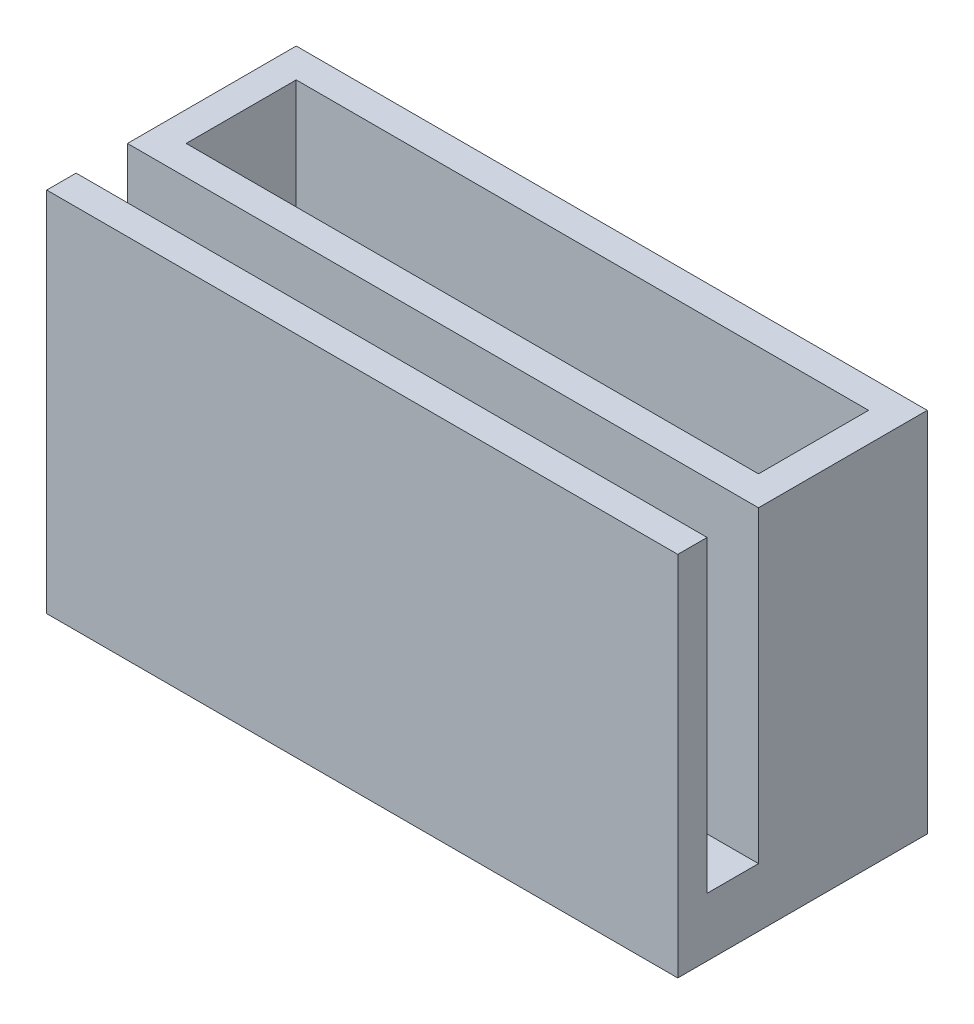
ISO-10303-21;
HEADER;
FILE_DESCRIPTION(('STEP AP214'),'2;1');
FILE_NAME('part.step','',(''),(''),'','','');
FILE_SCHEMA(('AUTOMOTIVE_DESIGN { 1 0 10303 214 1 1 1 1 }'));
ENDSEC;
DATA;
#1=APPLICATION_CONTEXT('core data for automotive mechanical design processes');
#2=APPLICATION_PROTOCOL_DEFINITION('international standard','automotive_design',2000,#1);
#3=PRODUCT_CONTEXT('',#1,'mechanical');
#4=PRODUCT('Part','Part','',(#3));
#5=PRODUCT_RELATED_PRODUCT_CATEGORY('part','',(#4));
#6=PRODUCT_DEFINITION_FORMATION('','',#4);
#7=PRODUCT_DEFINITION_CONTEXT('part definition',#1,'design');
#8=PRODUCT_DEFINITION('design','',#6,#7);
#9=PRODUCT_DEFINITION_SHAPE('','',#8);
#10=(LENGTH_UNIT() NAMED_UNIT(*) SI_UNIT(.MILLI.,.METRE.));
#11=(NAMED_UNIT(*) PLANE_ANGLE_UNIT() SI_UNIT($,.RADIAN.));
#12=(NAMED_UNIT(*) SI_UNIT($,.STERADIAN.) SOLID_ANGLE_UNIT());
#13=UNCERTAINTY_MEASURE_WITH_UNIT(LENGTH_MEASURE(1.E-05),#10,'distance_accuracy_value','');
#14=(GEOMETRIC_REPRESENTATION_CONTEXT(3) GLOBAL_UNCERTAINTY_ASSIGNED_CONTEXT((#13)) GLOBAL_UNIT_ASSIGNED_CONTEXT((#10,
#11,#12)) REPRESENTATION_CONTEXT('',''));
#15=CARTESIAN_POINT('',(0.,0.,0.));
#16=DIRECTION('',(0.,0.,1.));
#17=DIRECTION('',(1.,0.,0.));
#18=AXIS2_PLACEMENT_3D('',#15,#16,#17);
#19=CARTESIAN_POINT('',(0.,4.,0.));
#20=DIRECTION('',(0.,1.,0.));
#21=DIRECTION('',(0.,0.,1.));
#22=AXIS2_PLACEMENT_3D('',#19,#20,#21);
#23=PLANE('',#22);
#24=DIRECTION('',(0.,0.,-1.));
#25=VECTOR('',#24,1.);
#26=CARTESIAN_POINT('',(-2.,4.,2.));
#27=LINE('',#26,#25);
#28=CARTESIAN_POINT('',(-2.,4.,5.50000000000001));
#29=VERTEX_POINT('',#28);
#30=CARTESIAN_POINT('',(-2.,4.,2.));
#31=VERTEX_POINT('',#30);
#32=EDGE_CURVE('E148',#29,#31,#27,.T.);
#33=ORIENTED_EDGE('',*,*,#32,.F.);
#34=DIRECTION('',(-1.,0.,0.));
#35=VECTOR('',#34,1.);
#36=CARTESIAN_POINT('',(41.,4.,5.5));
#37=LINE('',#36,#35);
#38=CARTESIAN_POINT('',(41.,4.,5.5));
#39=VERTEX_POINT('',#38);
#40=EDGE_CURVE('E139',#39,#29,#37,.T.);
#41=ORIENTED_EDGE('',*,*,#40,.F.);
#42=DIRECTION('',(0.,0.,1.));
#43=VECTOR('',#42,1.);
#44=CARTESIAN_POINT('',(41.,4.,2.));
#45=LINE('',#44,#43);
#46=CARTESIAN_POINT('',(41.,4.,2.));
#47=VERTEX_POINT('',#46);
#48=EDGE_CURVE('E59',#47,#39,#45,.T.);
#49=ORIENTED_EDGE('',*,*,#48,.F.);
#50=DIRECTION('',(1.,0.,0.));
#51=VECTOR('',#50,1.);
#52=CARTESIAN_POINT('',(-2.,4.,2.));
#53=LINE('',#52,#51);
#54=EDGE_CURVE('E157',#31,#47,#53,.T.);
#55=ORIENTED_EDGE('',*,*,#54,.F.);
#56=EDGE_LOOP('',(#33,#41,#49,#55));
#57=FACE_BOUND('',#56,.T.);
#58=ADVANCED_FACE('F43',(#57),#23,.T.);
#59=CARTESIAN_POINT('',(0.,25.,0.));
#60=DIRECTION('',(0.,-1.,0.));
#61=DIRECTION('',(0.,0.,-1.));
#62=AXIS2_PLACEMENT_3D('',#59,#60,#61);
#63=PLANE('',#62);
#64=DIRECTION('',(0.,0.,1.));
#65=VECTOR('',#64,1.);
#66=CARTESIAN_POINT('',(-2.,25.,2.));
#67=LINE('',#66,#65);
#68=CARTESIAN_POINT('',(-2.,25.,-9.5));
#69=VERTEX_POINT('',#68);
#70=CARTESIAN_POINT('',(-2.,25.,2.));
#71=VERTEX_POINT('',#70);
#72=EDGE_CURVE('E217',#69,#71,#67,.T.);
#73=ORIENTED_EDGE('',*,*,#72,.T.);
#74=DIRECTION('',(1.,0.,0.));
#75=VECTOR('',#74,1.);
#76=CARTESIAN_POINT('',(-2.,25.,2.));
#77=LINE('',#76,#75);
#78=CARTESIAN_POINT('',(41.,25.,2.));
#79=VERTEX_POINT('',#78);
#80=EDGE_CURVE('E221',#71,#79,#77,.T.);
#81=ORIENTED_EDGE('',*,*,#80,.T.);
#82=DIRECTION('',(0.,0.,-1.));
#83=VECTOR('',#82,1.);
#84=CARTESIAN_POINT('',(41.,25.,2.));
#85=LINE('',#84,#83);
#86=CARTESIAN_POINT('',(41.,25.,-9.5));
#87=VERTEX_POINT('',#86);
#88=EDGE_CURVE('E225',#79,#87,#85,.T.);
#89=ORIENTED_EDGE('',*,*,#88,.T.);
#90=DIRECTION('',(-1.,0.,0.));
#91=VECTOR('',#90,1.);
#92=CARTESIAN_POINT('',(-2.,25.,-9.5));
#93=LINE('',#92,#91);
#94=EDGE_CURVE('E228',#87,#69,#93,.T.);
#95=ORIENTED_EDGE('',*,*,#94,.T.);
#96=EDGE_LOOP('',(#73,#81,#89,#95));
#97=FACE_BOUND('',#96,.T.);
#98=DIRECTION('',(0.,0.,1.));
#99=VECTOR('',#98,1.);
#100=CARTESIAN_POINT('',(0.,25.,0.));
#101=LINE('',#100,#99);
#102=CARTESIAN_POINT('',(0.,25.,-7.5));
#103=VERTEX_POINT('',#102);
#104=CARTESIAN_POINT('',(0.,25.,0.));
#105=VERTEX_POINT('',#104);
#106=EDGE_CURVE('E176',#103,#105,#101,.T.);
#107=ORIENTED_EDGE('',*,*,#106,.F.);
#108=DIRECTION('',(-1.,0.,0.));
#109=VECTOR('',#108,1.);
#110=CARTESIAN_POINT('',(0.,25.,-7.5));
#111=LINE('',#110,#109);
#112=CARTESIAN_POINT('',(39.,25.,-7.5));
#113=VERTEX_POINT('',#112);
#114=EDGE_CURVE('E186',#113,#103,#111,.T.);
#115=ORIENTED_EDGE('',*,*,#114,.F.);
#116=DIRECTION('',(0.,0.,-1.));
#117=VECTOR('',#116,1.);
#118=CARTESIAN_POINT('',(39.,25.,0.));
#119=LINE('',#118,#117);
#120=CARTESIAN_POINT('',(39.,25.,0.));
#121=VERTEX_POINT('',#120);
#122=EDGE_CURVE('E183',#121,#113,#119,.T.);
#123=ORIENTED_EDGE('',*,*,#122,.F.);
#124=DIRECTION('',(1.,0.,0.));
#125=VECTOR('',#124,1.);
#126=CARTESIAN_POINT('',(0.,25.,0.));
#127=LINE('',#126,#125);
#128=EDGE_CURVE('E179',#105,#121,#127,.T.);
#129=ORIENTED_EDGE('',*,*,#128,.F.);
#130=EDGE_LOOP('',(#107,#115,#123,#129));
#131=FACE_BOUND('',#130,.T.);
#132=ADVANCED_FACE('F277',(#97,#131),#63,.F.);
#133=CARTESIAN_POINT('',(0.,0.,0.));
#134=DIRECTION('',(0.,-1.,0.));
#135=DIRECTION('',(0.,0.,-1.));
#136=AXIS2_PLACEMENT_3D('',#133,#134,#135);
#137=PLANE('',#136);
#138=DIRECTION('',(0.,0.,1.));
#139=VECTOR('',#138,1.);
#140=CARTESIAN_POINT('',(-2.,0.,2.));
#141=LINE('',#140,#139);
#142=CARTESIAN_POINT('',(-2.,0.,-9.5));
#143=VERTEX_POINT('',#142);
#144=CARTESIAN_POINT('',(-2.,0.,7.5));
#145=VERTEX_POINT('',#144);
#146=EDGE_CURVE('E216',#143,#145,#141,.T.);
#147=ORIENTED_EDGE('',*,*,#146,.F.);
#148=DIRECTION('',(-1.,0.,0.));
#149=VECTOR('',#148,1.);
#150=CARTESIAN_POINT('',(-2.,0.,-9.5));
#151=LINE('',#150,#149);
#152=CARTESIAN_POINT('',(41.,0.,-9.5));
#153=VERTEX_POINT('',#152);
#154=EDGE_CURVE('E222',#153,#143,#151,.T.);
#155=ORIENTED_EDGE('',*,*,#154,.F.);
#156=DIRECTION('',(0.,0.,-1.));
#157=VECTOR('',#156,1.);
#158=CARTESIAN_POINT('',(41.,0.,2.));
#159=LINE('',#158,#157);
#160=CARTESIAN_POINT('',(41.,0.,7.5));
#161=VERTEX_POINT('',#160);
#162=EDGE_CURVE('E234',#161,#153,#159,.T.);
#163=ORIENTED_EDGE('',*,*,#162,.F.);
#164=DIRECTION('',(-1.,0.,0.));
#165=VECTOR('',#164,1.);
#166=CARTESIAN_POINT('',(-2.,0.,7.5));
#167=LINE('',#166,#165);
#168=EDGE_CURVE('E167',#161,#145,#167,.T.);
#169=ORIENTED_EDGE('',*,*,#168,.T.);
#170=EDGE_LOOP('',(#147,#155,#163,#169));
#171=FACE_BOUND('',#170,.T.);
#172=DIRECTION('',(-1.,0.,0.));
#173=VECTOR('',#172,1.);
#174=CARTESIAN_POINT('',(0.,0.,-7.5));
#175=LINE('',#174,#173);
#176=CARTESIAN_POINT('',(39.,0.,-7.5));
#177=VERTEX_POINT('',#176);
#178=CARTESIAN_POINT('',(0.,0.,-7.5));
#179=VERTEX_POINT('',#178);
#180=EDGE_CURVE('E180',#177,#179,#175,.T.);
#181=ORIENTED_EDGE('',*,*,#180,.T.);
#182=DIRECTION('',(0.,0.,1.));
#183=VECTOR('',#182,1.);
#184=CARTESIAN_POINT('',(0.,0.,0.));
#185=LINE('',#184,#183);
#186=CARTESIAN_POINT('',(0.,0.,0.));
#187=VERTEX_POINT('',#186);
#188=EDGE_CURVE('E174',#179,#187,#185,.T.);
#189=ORIENTED_EDGE('',*,*,#188,.T.);
#190=DIRECTION('',(1.,0.,0.));
#191=VECTOR('',#190,1.);
#192=CARTESIAN_POINT('',(0.,0.,0.));
#193=LINE('',#192,#191);
#194=CARTESIAN_POINT('',(39.,0.,0.));
#195=VERTEX_POINT('',#194);
#196=EDGE_CURVE('E193',#187,#195,#193,.T.);
#197=ORIENTED_EDGE('',*,*,#196,.T.);
#198=DIRECTION('',(0.,0.,-1.));
#199=VECTOR('',#198,1.);
#200=CARTESIAN_POINT('',(39.,0.,0.));
#201=LINE('',#200,#199);
#202=EDGE_CURVE('E197',#195,#177,#201,.T.);
#203=ORIENTED_EDGE('',*,*,#202,.T.);
#204=EDGE_LOOP('',(#181,#189,#197,#203));
#205=FACE_BOUND('',#204,.T.);
#206=ADVANCED_FACE('F254',(#171,#205),#137,.T.);
#207=CARTESIAN_POINT('',(-2.,25.,2.));
#208=DIRECTION('',(1.,0.,0.));
#209=DIRECTION('',(0.,0.,-1.));
#210=AXIS2_PLACEMENT_3D('',#207,#208,#209);
#211=PLANE('',#210);
#212=ORIENTED_EDGE('',*,*,#146,.T.);
#213=DIRECTION('',(0.,-1.,0.));
#214=VECTOR('',#213,1.);
#215=CARTESIAN_POINT('',(-2.,4.,7.5));
#216=LINE('',#215,#214);
#217=CARTESIAN_POINT('',(-2.,25.,7.50000000000001));
#218=VERTEX_POINT('',#217);
#219=EDGE_CURVE('E162',#218,#145,#216,.T.);
#220=ORIENTED_EDGE('',*,*,#219,.F.);
#221=DIRECTION('',(0.,0.,-1.));
#222=VECTOR('',#221,1.);
#223=CARTESIAN_POINT('',(-2.,25.,7.50000000000001));
#224=LINE('',#223,#222);
#225=CARTESIAN_POINT('',(-2.,25.,5.50000000000001));
#226=VERTEX_POINT('',#225);
#227=EDGE_CURVE('E267',#218,#226,#224,.T.);
#228=ORIENTED_EDGE('',*,*,#227,.T.);
#229=DIRECTION('',(0.,-1.,0.));
#230=VECTOR('',#229,1.);
#231=CARTESIAN_POINT('',(-2.,68.0464865000618,5.50000000000001));
#232=LINE('',#231,#230);
#233=EDGE_CURVE('E146',#226,#29,#232,.T.);
#234=ORIENTED_EDGE('',*,*,#233,.T.);
#235=ORIENTED_EDGE('',*,*,#32,.T.);
#236=DIRECTION('',(0.,-1.,0.));
#237=VECTOR('',#236,1.);
#238=CARTESIAN_POINT('',(-2.,25.,2.));
#239=LINE('',#238,#237);
#240=EDGE_CURVE('E11',#71,#31,#239,.T.);
#241=ORIENTED_EDGE('',*,*,#240,.F.);
#242=ORIENTED_EDGE('',*,*,#72,.F.);
#243=DIRECTION('',(0.,-1.,0.));
#244=VECTOR('',#243,1.);
#245=CARTESIAN_POINT('',(-2.,25.,-9.5));
#246=LINE('',#245,#244);
#247=EDGE_CURVE('E231',#69,#143,#246,.T.);
#248=ORIENTED_EDGE('',*,*,#247,.T.);
#249=EDGE_LOOP('',(#212,#220,#228,#234,#235,#241,#242,#248));
#250=FACE_BOUND('',#249,.T.);
#251=ADVANCED_FACE('F45',(#250),#211,.F.);
#252=CARTESIAN_POINT('',(-2.,25.,2.));
#253=DIRECTION('',(0.,0.,-1.));
#254=DIRECTION('',(-1.,0.,0.));
#255=AXIS2_PLACEMENT_3D('',#252,#253,#254);
#256=PLANE('',#255);
#257=ORIENTED_EDGE('',*,*,#240,.T.);
#258=ORIENTED_EDGE('',*,*,#54,.T.);
#259=DIRECTION('',(0.,-1.,0.));
#260=VECTOR('',#259,1.);
#261=CARTESIAN_POINT('',(41.,25.,2.));
#262=LINE('',#261,#260);
#263=EDGE_CURVE('E52',#79,#47,#262,.T.);
#264=ORIENTED_EDGE('',*,*,#263,.F.);
#265=ORIENTED_EDGE('',*,*,#80,.F.);
#266=EDGE_LOOP('',(#257,#258,#264,#265));
#267=FACE_BOUND('',#266,.T.);
#268=ADVANCED_FACE('F275',(#267),#256,.F.);
#269=CARTESIAN_POINT('',(41.,25.,2.));
#270=DIRECTION('',(-1.,0.,0.));
#271=DIRECTION('',(0.,0.,1.));
#272=AXIS2_PLACEMENT_3D('',#269,#270,#271);
#273=PLANE('',#272);
#274=ORIENTED_EDGE('',*,*,#162,.T.);
#275=DIRECTION('',(0.,-1.,0.));
#276=VECTOR('',#275,1.);
#277=CARTESIAN_POINT('',(41.,25.,-9.5));
#278=LINE('',#277,#276);
#279=EDGE_CURVE('E242',#87,#153,#278,.T.);
#280=ORIENTED_EDGE('',*,*,#279,.F.);
#281=ORIENTED_EDGE('',*,*,#88,.F.);
#282=ORIENTED_EDGE('',*,*,#263,.T.);
#283=ORIENTED_EDGE('',*,*,#48,.T.);
#284=DIRECTION('',(0.,-1.,0.));
#285=VECTOR('',#284,1.);
#286=CARTESIAN_POINT('',(41.,68.0464865000618,5.5));
#287=LINE('',#286,#285);
#288=CARTESIAN_POINT('',(41.,25.,5.5));
#289=VERTEX_POINT('',#288);
#290=EDGE_CURVE('E136',#289,#39,#287,.T.);
#291=ORIENTED_EDGE('',*,*,#290,.F.);
#292=DIRECTION('',(0.,0.,1.));
#293=VECTOR('',#292,1.);
#294=CARTESIAN_POINT('',(41.,25.,7.5));
#295=LINE('',#294,#293);
#296=CARTESIAN_POINT('',(41.,25.,7.5));
#297=VERTEX_POINT('',#296);
#298=EDGE_CURVE('E171',#289,#297,#295,.T.);
#299=ORIENTED_EDGE('',*,*,#298,.T.);
#300=DIRECTION('',(0.,-1.,0.));
#301=VECTOR('',#300,1.);
#302=CARTESIAN_POINT('',(41.,4.,7.5));
#303=LINE('',#302,#301);
#304=EDGE_CURVE('E156',#297,#161,#303,.T.);
#305=ORIENTED_EDGE('',*,*,#304,.T.);
#306=EDGE_LOOP('',(#274,#280,#281,#282,#283,#291,#299,#305));
#307=FACE_BOUND('',#306,.T.);
#308=ADVANCED_FACE('F152',(#307),#273,.F.);
#309=CARTESIAN_POINT('',(-2.,25.,-9.5));
#310=DIRECTION('',(0.,0.,1.));
#311=DIRECTION('',(1.,0.,0.));
#312=AXIS2_PLACEMENT_3D('',#309,#310,#311);
#313=PLANE('',#312);
#314=ORIENTED_EDGE('',*,*,#154,.T.);
#315=ORIENTED_EDGE('',*,*,#247,.F.);
#316=ORIENTED_EDGE('',*,*,#94,.F.);
#317=ORIENTED_EDGE('',*,*,#279,.T.);
#318=EDGE_LOOP('',(#314,#315,#316,#317));
#319=FACE_BOUND('',#318,.T.);
#320=ADVANCED_FACE('F250',(#319),#313,.F.);
#321=CARTESIAN_POINT('',(0.,25.,0.));
#322=DIRECTION('',(1.,0.,0.));
#323=DIRECTION('',(0.,0.,-1.));
#324=AXIS2_PLACEMENT_3D('',#321,#322,#323);
#325=PLANE('',#324);
#326=ORIENTED_EDGE('',*,*,#188,.F.);
#327=DIRECTION('',(0.,-1.,0.));
#328=VECTOR('',#327,1.);
#329=CARTESIAN_POINT('',(0.,25.,-7.5));
#330=LINE('',#329,#328);
#331=EDGE_CURVE('E189',#103,#179,#330,.T.);
#332=ORIENTED_EDGE('',*,*,#331,.F.);
#333=ORIENTED_EDGE('',*,*,#106,.T.);
#334=DIRECTION('',(0.,-1.,0.));
#335=VECTOR('',#334,1.);
#336=CARTESIAN_POINT('',(0.,25.,0.));
#337=LINE('',#336,#335);
#338=EDGE_CURVE('E212',#105,#187,#337,.T.);
#339=ORIENTED_EDGE('',*,*,#338,.T.);
#340=EDGE_LOOP('',(#326,#332,#333,#339));
#341=FACE_BOUND('',#340,.T.);
#342=ADVANCED_FACE('F288',(#341),#325,.T.);
#343=CARTESIAN_POINT('',(0.,25.,0.));
#344=DIRECTION('',(0.,0.,-1.));
#345=DIRECTION('',(-1.,0.,0.));
#346=AXIS2_PLACEMENT_3D('',#343,#344,#345);
#347=PLANE('',#346);
#348=ORIENTED_EDGE('',*,*,#196,.F.);
#349=ORIENTED_EDGE('',*,*,#338,.F.);
#350=ORIENTED_EDGE('',*,*,#128,.T.);
#351=DIRECTION('',(0.,-1.,0.));
#352=VECTOR('',#351,1.);
#353=CARTESIAN_POINT('',(39.,25.,0.));
#354=LINE('',#353,#352);
#355=EDGE_CURVE('E209',#121,#195,#354,.T.);
#356=ORIENTED_EDGE('',*,*,#355,.T.);
#357=EDGE_LOOP('',(#348,#349,#350,#356));
#358=FACE_BOUND('',#357,.T.);
#359=ADVANCED_FACE('F290',(#358),#347,.T.);
#360=CARTESIAN_POINT('',(39.,25.,0.));
#361=DIRECTION('',(-1.,0.,0.));
#362=DIRECTION('',(0.,0.,1.));
#363=AXIS2_PLACEMENT_3D('',#360,#361,#362);
#364=PLANE('',#363);
#365=ORIENTED_EDGE('',*,*,#202,.F.);
#366=ORIENTED_EDGE('',*,*,#355,.F.);
#367=ORIENTED_EDGE('',*,*,#122,.T.);
#368=DIRECTION('',(0.,-1.,0.));
#369=VECTOR('',#368,1.);
#370=CARTESIAN_POINT('',(39.,25.,-7.5));
#371=LINE('',#370,#369);
#372=EDGE_CURVE('E67',#113,#177,#371,.T.);
#373=ORIENTED_EDGE('',*,*,#372,.T.);
#374=EDGE_LOOP('',(#365,#366,#367,#373));
#375=FACE_BOUND('',#374,.T.);
#376=ADVANCED_FACE('F295',(#375),#364,.T.);
#377=CARTESIAN_POINT('',(0.,25.,-7.5));
#378=DIRECTION('',(0.,0.,1.));
#379=DIRECTION('',(1.,0.,0.));
#380=AXIS2_PLACEMENT_3D('',#377,#378,#379);
#381=PLANE('',#380);
#382=ORIENTED_EDGE('',*,*,#180,.F.);
#383=ORIENTED_EDGE('',*,*,#372,.F.);
#384=ORIENTED_EDGE('',*,*,#114,.T.);
#385=ORIENTED_EDGE('',*,*,#331,.T.);
#386=EDGE_LOOP('',(#382,#383,#384,#385));
#387=FACE_BOUND('',#386,.T.);
#388=ADVANCED_FACE('F293',(#387),#381,.T.);
#389=CARTESIAN_POINT('',(-2.,4.,7.5));
#390=DIRECTION('',(0.,0.,1.));
#391=DIRECTION('',(1.,0.,0.));
#392=AXIS2_PLACEMENT_3D('',#389,#390,#391);
#393=PLANE('',#392);
#394=ORIENTED_EDGE('',*,*,#168,.F.);
#395=ORIENTED_EDGE('',*,*,#304,.F.);
#396=DIRECTION('',(-1.,0.,0.));
#397=VECTOR('',#396,1.);
#398=CARTESIAN_POINT('',(41.,25.,7.5));
#399=LINE('',#398,#397);
#400=EDGE_CURVE('E145',#297,#218,#399,.T.);
#401=ORIENTED_EDGE('',*,*,#400,.T.);
#402=ORIENTED_EDGE('',*,*,#219,.T.);
#403=EDGE_LOOP('',(#394,#395,#401,#402));
#404=FACE_BOUND('',#403,.T.);
#405=ADVANCED_FACE('F263',(#404),#393,.T.);
#406=CARTESIAN_POINT('',(41.,68.0464865000618,5.5));
#407=DIRECTION('',(0.,0.,1.));
#408=DIRECTION('',(1.,0.,0.));
#409=AXIS2_PLACEMENT_3D('',#406,#407,#408);
#410=PLANE('',#409);
#411=ORIENTED_EDGE('',*,*,#233,.F.);
#412=DIRECTION('',(1.,0.,0.));
#413=VECTOR('',#412,1.);
#414=CARTESIAN_POINT('',(41.,25.,5.5));
#415=LINE('',#414,#413);
#416=EDGE_CURVE('E141',#226,#289,#415,.T.);
#417=ORIENTED_EDGE('',*,*,#416,.T.);
#418=ORIENTED_EDGE('',*,*,#290,.T.);
#419=ORIENTED_EDGE('',*,*,#40,.T.);
#420=EDGE_LOOP('',(#411,#417,#418,#419));
#421=FACE_BOUND('',#420,.T.);
#422=ADVANCED_FACE('F138',(#421),#410,.F.);
#423=CARTESIAN_POINT('',(0.,25.,0.));
#424=DIRECTION('',(0.,-1.,0.));
#425=DIRECTION('',(0.,0.,-1.));
#426=AXIS2_PLACEMENT_3D('',#423,#424,#425);
#427=PLANE('',#426);
#428=ORIENTED_EDGE('',*,*,#416,.F.);
#429=ORIENTED_EDGE('',*,*,#227,.F.);
#430=ORIENTED_EDGE('',*,*,#400,.F.);
#431=ORIENTED_EDGE('',*,*,#298,.F.);
#432=EDGE_LOOP('',(#428,#429,#430,#431));
#433=FACE_BOUND('',#432,.T.);
#434=ADVANCED_FACE('F311',(#433),#427,.F.);
#435=CLOSED_SHELL('',(#58,#132,#206,#251,#268,#308,#320,#342,#359,#376,#388,#405,#422,#434));
#436=MANIFOLD_SOLID_BREP('B2',#435);
#437=ADVANCED_BREP_SHAPE_REPRESENTATION('',(#18,#436),#14);
#438=SHAPE_DEFINITION_REPRESENTATION(#9,#437);
ENDSEC;
END-ISO-10303-21;
